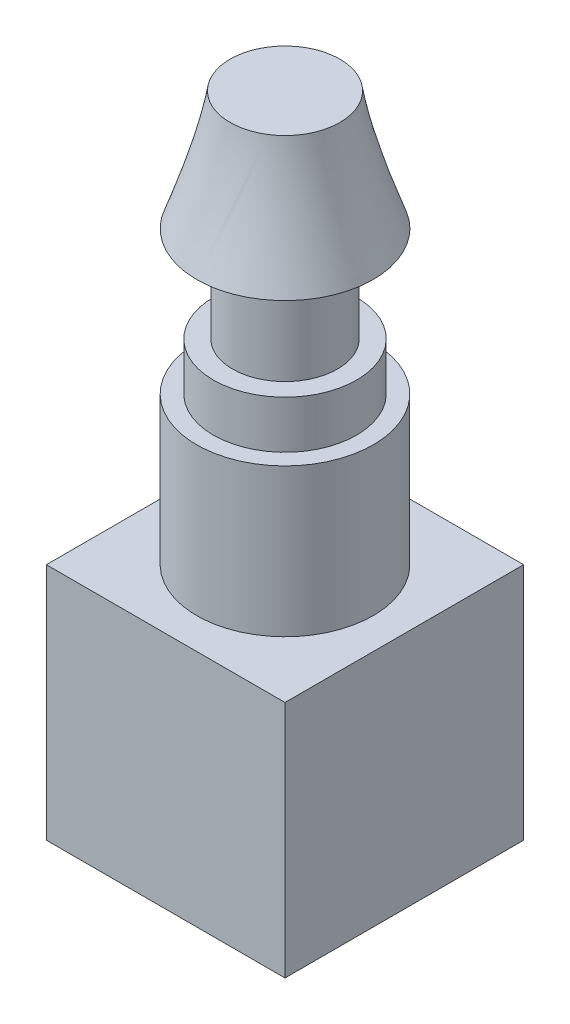
ISO-10303-21;
HEADER;
FILE_DESCRIPTION(('STEP AP214'),'2;1');
FILE_NAME('part.step','',(''),(''),'','','');
FILE_SCHEMA(('AUTOMOTIVE_DESIGN { 1 0 10303 214 1 1 1 1 }'));
ENDSEC;
DATA;
#1=APPLICATION_CONTEXT('core data for automotive mechanical design processes');
#2=APPLICATION_PROTOCOL_DEFINITION('international standard','automotive_design',2000,#1);
#3=PRODUCT_CONTEXT('',#1,'mechanical');
#4=PRODUCT('Part','Part','',(#3));
#5=PRODUCT_RELATED_PRODUCT_CATEGORY('part','',(#4));
#6=PRODUCT_DEFINITION_FORMATION('','',#4);
#7=PRODUCT_DEFINITION_CONTEXT('part definition',#1,'design');
#8=PRODUCT_DEFINITION('design','',#6,#7);
#9=PRODUCT_DEFINITION_SHAPE('','',#8);
#10=(LENGTH_UNIT() NAMED_UNIT(*) SI_UNIT(.MILLI.,.METRE.));
#11=(NAMED_UNIT(*) PLANE_ANGLE_UNIT() SI_UNIT($,.RADIAN.));
#12=(NAMED_UNIT(*) SI_UNIT($,.STERADIAN.) SOLID_ANGLE_UNIT());
#13=UNCERTAINTY_MEASURE_WITH_UNIT(LENGTH_MEASURE(1.E-05),#10,'distance_accuracy_value','');
#14=(GEOMETRIC_REPRESENTATION_CONTEXT(3) GLOBAL_UNCERTAINTY_ASSIGNED_CONTEXT((#13)) GLOBAL_UNIT_ASSIGNED_CONTEXT((#10,
#11,#12)) REPRESENTATION_CONTEXT('',''));
#15=CARTESIAN_POINT('',(0.,0.,0.));
#16=DIRECTION('',(0.,0.,1.));
#17=DIRECTION('',(1.,0.,0.));
#18=AXIS2_PLACEMENT_3D('',#15,#16,#17);
#19=CARTESIAN_POINT('',(0.,3.1,0.));
#20=DIRECTION('',(0.,-1.,0.));
#21=DIRECTION('',(0.,0.,-1.));
#22=AXIS2_PLACEMENT_3D('',#19,#20,#21);
#23=CYLINDRICAL_SURFACE('',#22,1.85);
#24=CARTESIAN_POINT('',(0.,3.1,0.));
#25=DIRECTION('',(0.,1.,0.));
#26=DIRECTION('',(0.,0.,1.));
#27=AXIS2_PLACEMENT_3D('',#24,#25,#26);
#28=CIRCLE('',#27,1.85);
#29=CARTESIAN_POINT('',(0.,3.1,-1.85));
#30=VERTEX_POINT('',#29);
#31=EDGE_CURVE('E175',#30,#30,#28,.T.);
#32=CARTESIAN_POINT('',(0.,0.,0.));
#33=DIRECTION('',(0.,1.,0.));
#34=DIRECTION('',(0.,0.,1.));
#35=AXIS2_PLACEMENT_3D('',#32,#33,#34);
#36=CIRCLE('',#35,1.85);
#37=CARTESIAN_POINT('',(0.,0.,-1.85));
#38=VERTEX_POINT('',#37);
#39=EDGE_CURVE('E42',#38,#38,#36,.T.);
#40=CARTESIAN_POINT('',(0.,3.1,-1.85));
#41=CARTESIAN_POINT('',(0.,3.06770833333333,-1.85));
#42=CARTESIAN_POINT('',(0.,3.03541666666667,-1.85));
#43=CARTESIAN_POINT('',(0.,2.97083333333333,-1.85));
#44=CARTESIAN_POINT('',(0.,2.93854166666667,-1.85));
#45=CARTESIAN_POINT('',(0.,2.87395833333333,-1.85));
#46=CARTESIAN_POINT('',(0.,2.84166666666667,-1.85));
#47=CARTESIAN_POINT('',(0.,2.77708333333333,-1.85));
#48=CARTESIAN_POINT('',(0.,2.74479166666667,-1.85));
#49=CARTESIAN_POINT('',(0.,2.68020833333333,-1.85));
#50=CARTESIAN_POINT('',(0.,2.64791666666667,-1.85));
#51=CARTESIAN_POINT('',(0.,2.58333333333333,-1.85));
#52=CARTESIAN_POINT('',(0.,2.55104166666667,-1.85));
#53=CARTESIAN_POINT('',(0.,2.48645833333333,-1.85));
#54=CARTESIAN_POINT('',(0.,2.45416666666667,-1.85));
#55=CARTESIAN_POINT('',(0.,2.38958333333333,-1.85));
#56=CARTESIAN_POINT('',(0.,2.35729166666667,-1.85));
#57=CARTESIAN_POINT('',(0.,2.29270833333333,-1.85));
#58=CARTESIAN_POINT('',(0.,2.26041666666667,-1.85));
#59=CARTESIAN_POINT('',(0.,2.19583333333333,-1.85));
#60=CARTESIAN_POINT('',(0.,2.16354166666667,-1.85));
#61=CARTESIAN_POINT('',(0.,2.09895833333333,-1.85));
#62=CARTESIAN_POINT('',(0.,2.06666666666667,-1.85));
#63=CARTESIAN_POINT('',(0.,2.00208333333333,-1.85));
#64=CARTESIAN_POINT('',(0.,1.96979166666667,-1.85));
#65=CARTESIAN_POINT('',(0.,1.90520833333333,-1.85));
#66=CARTESIAN_POINT('',(0.,1.87291666666667,-1.85));
#67=CARTESIAN_POINT('',(0.,1.80833333333333,-1.85));
#68=CARTESIAN_POINT('',(0.,1.77604166666667,-1.85));
#69=CARTESIAN_POINT('',(0.,1.71145833333333,-1.85));
#70=CARTESIAN_POINT('',(0.,1.67916666666667,-1.85));
#71=CARTESIAN_POINT('',(0.,1.61458333333333,-1.85));
#72=CARTESIAN_POINT('',(0.,1.58229166666667,-1.85));
#73=CARTESIAN_POINT('',(0.,1.51770833333333,-1.85));
#74=CARTESIAN_POINT('',(0.,1.48541666666667,-1.85));
#75=CARTESIAN_POINT('',(0.,1.42083333333333,-1.85));
#76=CARTESIAN_POINT('',(0.,1.38854166666667,-1.85));
#77=CARTESIAN_POINT('',(0.,1.32395833333333,-1.85));
#78=CARTESIAN_POINT('',(0.,1.29166666666667,-1.85));
#79=CARTESIAN_POINT('',(0.,1.22708333333333,-1.85));
#80=CARTESIAN_POINT('',(0.,1.19479166666667,-1.85));
#81=CARTESIAN_POINT('',(0.,1.13020833333333,-1.85));
#82=CARTESIAN_POINT('',(0.,1.09791666666667,-1.85));
#83=CARTESIAN_POINT('',(0.,1.03333333333333,-1.85));
#84=CARTESIAN_POINT('',(0.,1.00104166666667,-1.85));
#85=CARTESIAN_POINT('',(0.,0.936458333333333,-1.85));
#86=CARTESIAN_POINT('',(0.,0.904166666666667,-1.85));
#87=CARTESIAN_POINT('',(0.,0.839583333333333,-1.85));
#88=CARTESIAN_POINT('',(0.,0.807291666666667,-1.85));
#89=CARTESIAN_POINT('',(0.,0.742708333333333,-1.85));
#90=CARTESIAN_POINT('',(0.,0.710416666666667,-1.85));
#91=CARTESIAN_POINT('',(0.,0.645833333333333,-1.85));
#92=CARTESIAN_POINT('',(0.,0.613541666666667,-1.85));
#93=CARTESIAN_POINT('',(0.,0.548958333333333,-1.85));
#94=CARTESIAN_POINT('',(0.,0.516666666666667,-1.85));
#95=CARTESIAN_POINT('',(0.,0.452083333333333,-1.85));
#96=CARTESIAN_POINT('',(0.,0.419791666666667,-1.85));
#97=CARTESIAN_POINT('',(0.,0.355208333333333,-1.85));
#98=CARTESIAN_POINT('',(0.,0.322916666666667,-1.85));
#99=CARTESIAN_POINT('',(0.,0.258333333333333,-1.85));
#100=CARTESIAN_POINT('',(0.,0.226041666666667,-1.85));
#101=CARTESIAN_POINT('',(0.,0.161458333333333,-1.85));
#102=CARTESIAN_POINT('',(0.,0.129166666666667,-1.85));
#103=CARTESIAN_POINT('',(0.,0.0645833333333335,-1.85));
#104=CARTESIAN_POINT('',(0.,0.0322916666666667,-1.85));
#105=CARTESIAN_POINT('',(0.,0.,-1.85));
#106=B_SPLINE_CURVE_WITH_KNOTS('',3,(#40,#41,#42,#43,#44,#45,#46,#47,#48,#49,#50,#51,#52,#53,
#54,#55,#56,#57,#58,#59,#60,#61,#62,#63,#64,#65,#66,#67,#68,#69,#70,#71,#72,#73,#74,#75,#76,#77,
#78,#79,#80,#81,#82,#83,#84,#85,#86,#87,#88,#89,#90,#91,#92,#93,#94,#95,#96,#97,#98,#99,#100,
#101,#102,#103,#104,#105),.UNSPECIFIED.,.F.,.F.,(4,2,2,2,2,2,2,2,2,2,2,2,2,2,2,2,2,2,2,2,2,2,2,
2,2,2,2,2,2,2,2,2,4),(0.,0.0968749999999997,0.19375,0.290625,0.3875,0.484375,0.58125,0.678125,
0.775,0.871874999999999,0.96875,1.065625,1.1625,1.259375,1.35625,1.453125,1.55,1.646875,1.74375,
1.840625,1.9375,2.034375,2.13125,2.228125,2.325,2.421875,2.51875,2.615625,2.7125,2.809375,
2.90625,3.003125,3.1),.UNSPECIFIED.);
#107=EDGE_CURVE('BSEAM39',#30,#38,#106,.T.);
#108=ORIENTED_EDGE('',*,*,#31,.F.);
#109=ORIENTED_EDGE('',*,*,#39,.T.);
#110=ORIENTED_EDGE('',*,*,#107,.T.);
#111=ORIENTED_EDGE('',*,*,#107,.F.);
#112=EDGE_LOOP('',(#108,#110,#109,#111));
#113=FACE_BOUND('',#112,.T.);
#114=ADVANCED_FACE('F39',(#113),#23,.T.);
#115=CARTESIAN_POINT('',(0.,3.1,0.));
#116=DIRECTION('',(0.,1.,0.));
#117=DIRECTION('',(0.,0.,1.));
#118=AXIS2_PLACEMENT_3D('',#115,#116,#117);
#119=PLANE('',#118);
#120=CARTESIAN_POINT('',(0.,3.1,0.));
#121=DIRECTION('',(0.,1.,0.));
#122=DIRECTION('',(0.,0.,1.));
#123=AXIS2_PLACEMENT_3D('',#120,#121,#122);
#124=CIRCLE('',#123,1.5);
#125=CARTESIAN_POINT('',(0.,3.1,1.5));
#126=VERTEX_POINT('',#125);
#127=EDGE_CURVE('E48',#126,#126,#124,.T.);
#128=ORIENTED_EDGE('',*,*,#127,.F.);
#129=EDGE_LOOP('',(#128));
#130=FACE_BOUND('',#129,.T.);
#131=ORIENTED_EDGE('',*,*,#31,.T.);
#132=EDGE_LOOP('',(#131));
#133=FACE_BOUND('',#132,.T.);
#134=ADVANCED_FACE('F180',(#130,#133),#119,.T.);
#135=CARTESIAN_POINT('',(0.,4.1,0.));
#136=DIRECTION('',(0.,-1.,0.));
#137=DIRECTION('',(0.,0.,-1.));
#138=AXIS2_PLACEMENT_3D('',#135,#136,#137);
#139=CYLINDRICAL_SURFACE('',#138,1.5);
#140=CARTESIAN_POINT('',(0.,4.1,0.));
#141=DIRECTION('',(0.,1.,0.));
#142=DIRECTION('',(0.,0.,1.));
#143=AXIS2_PLACEMENT_3D('',#140,#141,#142);
#144=CIRCLE('',#143,1.5);
#145=CARTESIAN_POINT('',(0.,4.1,1.5));
#146=VERTEX_POINT('',#145);
#147=EDGE_CURVE('E171',#146,#146,#144,.T.);
#148=ORIENTED_EDGE('',*,*,#147,.F.);
#149=EDGE_LOOP('',(#148));
#150=FACE_BOUND('',#149,.T.);
#151=ORIENTED_EDGE('',*,*,#127,.T.);
#152=EDGE_LOOP('',(#151));
#153=FACE_BOUND('',#152,.T.);
#154=ADVANCED_FACE('F203',(#150,#153),#139,.T.);
#155=CARTESIAN_POINT('',(0.,4.1,0.));
#156=DIRECTION('',(0.,1.,0.));
#157=DIRECTION('',(0.,0.,1.));
#158=AXIS2_PLACEMENT_3D('',#155,#156,#157);
#159=PLANE('',#158);
#160=CARTESIAN_POINT('',(0.,4.1,0.));
#161=DIRECTION('',(0.,1.,0.));
#162=DIRECTION('',(0.,0.,1.));
#163=AXIS2_PLACEMENT_3D('',#160,#161,#162);
#164=CIRCLE('',#163,1.1);
#165=CARTESIAN_POINT('',(0.,4.1,1.1));
#166=VERTEX_POINT('',#165);
#167=EDGE_CURVE('E12',#166,#166,#164,.T.);
#168=ORIENTED_EDGE('',*,*,#167,.F.);
#169=EDGE_LOOP('',(#168));
#170=FACE_BOUND('',#169,.T.);
#171=ORIENTED_EDGE('',*,*,#147,.T.);
#172=EDGE_LOOP('',(#171));
#173=FACE_BOUND('',#172,.T.);
#174=ADVANCED_FACE('F198',(#170,#173),#159,.T.);
#175=CARTESIAN_POINT('',(0.,6.1,0.));
#176=DIRECTION('',(0.,-1.,0.));
#177=DIRECTION('',(0.,0.,-1.));
#178=AXIS2_PLACEMENT_3D('',#175,#176,#177);
#179=CYLINDRICAL_SURFACE('',#178,1.1);
#180=CARTESIAN_POINT('',(0.,6.1,0.));
#181=DIRECTION('',(0.,1.,0.));
#182=DIRECTION('',(0.,0.,1.));
#183=AXIS2_PLACEMENT_3D('',#180,#181,#182);
#184=CIRCLE('',#183,1.1);
#185=CARTESIAN_POINT('',(0.,6.1,1.1));
#186=VERTEX_POINT('',#185);
#187=EDGE_CURVE('E167',#186,#186,#184,.T.);
#188=ORIENTED_EDGE('',*,*,#187,.F.);
#189=EDGE_LOOP('',(#188));
#190=FACE_BOUND('',#189,.T.);
#191=ORIENTED_EDGE('',*,*,#167,.T.);
#192=EDGE_LOOP('',(#191));
#193=FACE_BOUND('',#192,.T.);
#194=ADVANCED_FACE('F154',(#190,#193),#179,.T.);
#195=CARTESIAN_POINT('',(0.,8.6,0.));
#196=DIRECTION('',(0.,1.,0.));
#197=DIRECTION('',(0.,0.,1.));
#198=AXIS2_PLACEMENT_3D('',#195,#196,#197);
#199=PLANE('',#198);
#200=CARTESIAN_POINT('',(0.,8.6,0.));
#201=DIRECTION('',(0.,1.,0.));
#202=DIRECTION('',(0.,0.,1.));
#203=AXIS2_PLACEMENT_3D('',#200,#201,#202);
#204=CIRCLE('',#203,1.15);
#205=CARTESIAN_POINT('',(0.620465420838555,8.6,0.968257538851949));
#206=VERTEX_POINT('',#205);
#207=EDGE_CURVE('E122',#206,#206,#204,.T.);
#208=ORIENTED_EDGE('',*,*,#207,.T.);
#209=EDGE_LOOP('',(#208));
#210=FACE_BOUND('',#209,.T.);
#211=ADVANCED_FACE('F145',(#210),#199,.T.);
#212=CARTESIAN_POINT('',(0.,6.1,0.));
#213=DIRECTION('',(0.,1.,0.));
#214=DIRECTION('',(0.,0.,1.));
#215=AXIS2_PLACEMENT_3D('',#212,#213,#214);
#216=PLANE('',#215);
#217=ORIENTED_EDGE('',*,*,#187,.T.);
#218=EDGE_LOOP('',(#217));
#219=FACE_BOUND('',#218,.T.);
#220=CARTESIAN_POINT('',(0.,6.1,0.));
#221=DIRECTION('',(0.,1.,0.));
#222=DIRECTION('',(0.,0.,1.));
#223=AXIS2_PLACEMENT_3D('',#220,#221,#222);
#224=CIRCLE('',#223,1.85);
#225=CARTESIAN_POINT('',(0.,6.1,1.85));
#226=VERTEX_POINT('',#225);
#227=EDGE_CURVE('E127',#226,#226,#224,.T.);
#228=ORIENTED_EDGE('',*,*,#227,.F.);
#229=EDGE_LOOP('',(#228));
#230=FACE_BOUND('',#229,.T.);
#231=ADVANCED_FACE('F142',(#219,#230),#216,.F.);
#232=CARTESIAN_POINT('',(0.,6.1,1.85));
#233=CARTESIAN_POINT('',(0.620465420838555,8.6,0.968257538851949));
#234=CARTESIAN_POINT('',(3.7,6.1,1.85));
#235=CARTESIAN_POINT('',(2.55698049854245,8.6,-0.272673302825161));
#236=CARTESIAN_POINT('',(3.7,6.1,-1.85));
#237=CARTESIAN_POINT('',(1.31604965686534,8.6,-2.20918838052906));
#238=CARTESIAN_POINT('',(0.,6.1,-1.85));
#239=CARTESIAN_POINT('',(-0.620465420838555,8.6,-0.96825753885195));
#240=CARTESIAN_POINT('',(-3.7,6.1,-1.85));
#241=CARTESIAN_POINT('',(-2.55698049854246,8.6,0.272673302825162));
#242=CARTESIAN_POINT('',(-3.7,6.1,1.85));
#243=CARTESIAN_POINT('',(-1.31604965686534,8.6,2.20918838052906));
#244=CARTESIAN_POINT('',(0.,6.1,1.85));
#245=CARTESIAN_POINT('',(0.620465420838555,8.6,0.968257538851949));
#246=(BOUNDED_SURFACE() B_SPLINE_SURFACE(3,1,((#232,#233),(#234,#235),(#236,#237),(#238,#239),
(#240,#241),(#242,#243),(#244,#245)),.UNSPECIFIED.,.T.,.F.,.F.) B_SPLINE_SURFACE_WITH_KNOTS((4,
3,4),(2,2),(0.,0.5,1.),(0.,1.),
.UNSPECIFIED.) GEOMETRIC_REPRESENTATION_ITEM() RATIONAL_B_SPLINE_SURFACE(((1.,1.),
(0.333333333333333,0.333333333333333),(0.333333333333333,0.333333333333333),(1.,1.),
(0.333333333333333,0.333333333333333),(0.333333333333333,0.333333333333333),(1.,1.))) REPRESENTATION_ITEM('') SURFACE());
#247=CARTESIAN_POINT('',(0.,6.1,1.85));
#248=CARTESIAN_POINT('',(0.00646318146706835,6.12604166666667,1.84081518269637));
#249=CARTESIAN_POINT('',(0.0129263629341366,6.15208333333333,1.83163036539275));
#250=CARTESIAN_POINT('',(0.0258527258682731,6.20416666666667,1.8132607307855));
#251=CARTESIAN_POINT('',(0.0323159073353414,6.23020833333333,1.80407591348187));
#252=CARTESIAN_POINT('',(0.045242270269478,6.28229166666667,1.78570627887462));
#253=CARTESIAN_POINT('',(0.0517054517365463,6.30833333333333,1.776521461571));
#254=CARTESIAN_POINT('',(0.0646318146706829,6.36041666666667,1.75815182696374));
#255=CARTESIAN_POINT('',(0.0710949961377511,6.38645833333333,1.74896700966012));
#256=CARTESIAN_POINT('',(0.0840213590718877,6.43854166666667,1.73059737505287));
#257=CARTESIAN_POINT('',(0.090484540538956,6.46458333333333,1.72141255774924));
#258=CARTESIAN_POINT('',(0.103410903473093,6.51666666666667,1.70304292314199));
#259=CARTESIAN_POINT('',(0.109874084940161,6.54270833333333,1.69385810583837));
#260=CARTESIAN_POINT('',(0.122800447874297,6.59479166666667,1.67548847123112));
#261=CARTESIAN_POINT('',(0.129263629341366,6.62083333333333,1.66630365392749));
#262=CARTESIAN_POINT('',(0.142189992275502,6.67291666666667,1.64793401932024));
#263=CARTESIAN_POINT('',(0.148653173742571,6.69895833333333,1.63874920201661));
#264=CARTESIAN_POINT('',(0.161579536676707,6.75104166666667,1.62037956740936));
#265=CARTESIAN_POINT('',(0.168042718143775,6.77708333333333,1.61119475010574));
#266=CARTESIAN_POINT('',(0.180969081077912,6.82916666666667,1.59282511549849));
#267=CARTESIAN_POINT('',(0.18743226254498,6.85520833333333,1.58364029819486));
#268=CARTESIAN_POINT('',(0.200358625479117,6.90729166666667,1.56527066358761));
#269=CARTESIAN_POINT('',(0.206821806946185,6.93333333333333,1.55608584628398));
#270=CARTESIAN_POINT('',(0.219748169880322,6.98541666666667,1.53771621167673));
#271=CARTESIAN_POINT('',(0.22621135134739,7.01145833333333,1.52853139437311));
#272=CARTESIAN_POINT('',(0.239137714281527,7.06354166666667,1.51016175976586));
#273=CARTESIAN_POINT('',(0.245600895748595,7.08958333333333,1.50097694246223));
#274=CARTESIAN_POINT('',(0.258527258682731,7.14166666666667,1.48260730785498));
#275=CARTESIAN_POINT('',(0.2649904401498,7.16770833333333,1.47342249055135));
#276=CARTESIAN_POINT('',(0.277916803083936,7.21979166666667,1.4550528559441));
#277=CARTESIAN_POINT('',(0.284379984551005,7.24583333333333,1.44586803864048));
#278=CARTESIAN_POINT('',(0.297306347485141,7.29791666666667,1.42749840403323));
#279=CARTESIAN_POINT('',(0.303769528952209,7.32395833333333,1.4183135867296));
#280=CARTESIAN_POINT('',(0.316695891886346,7.37604166666667,1.39994395212235));
#281=CARTESIAN_POINT('',(0.323159073353414,7.40208333333333,1.39075913481872));
#282=CARTESIAN_POINT('',(0.336085436287551,7.45416666666667,1.37238950021147));
#283=CARTESIAN_POINT('',(0.342548617754619,7.48020833333333,1.36320468290785));
#284=CARTESIAN_POINT('',(0.355474980688756,7.53229166666667,1.3448350483006));
#285=CARTESIAN_POINT('',(0.361938162155824,7.55833333333333,1.33565023099697));
#286=CARTESIAN_POINT('',(0.374864525089961,7.61041666666667,1.31728059638972));
#287=CARTESIAN_POINT('',(0.381327706557029,7.63645833333333,1.30809577908609));
#288=CARTESIAN_POINT('',(0.394254069491165,7.68854166666667,1.28972614447884));
#289=CARTESIAN_POINT('',(0.400717250958234,7.71458333333333,1.28054132717522));
#290=CARTESIAN_POINT('',(0.41364361389237,7.76666666666667,1.26217169256797));
#291=CARTESIAN_POINT('',(0.420106795359439,7.79270833333333,1.25298687526434));
#292=CARTESIAN_POINT('',(0.433033158293575,7.84479166666667,1.23461724065709));
#293=CARTESIAN_POINT('',(0.439496339760643,7.87083333333333,1.22543242335346));
#294=CARTESIAN_POINT('',(0.45242270269478,7.92291666666667,1.20706278874621));
#295=CARTESIAN_POINT('',(0.458885884161848,7.94895833333333,1.19787797144259));
#296=CARTESIAN_POINT('',(0.471812247095985,8.00104166666667,1.17950833683534));
#297=CARTESIAN_POINT('',(0.478275428563053,8.02708333333333,1.17032351953171));
#298=CARTESIAN_POINT('',(0.49120179149719,8.07916666666667,1.15195388492446));
#299=CARTESIAN_POINT('',(0.497664972964258,8.10520833333333,1.14276906762083));
#300=CARTESIAN_POINT('',(0.510591335898395,8.15729166666667,1.12439943301358));
#301=CARTESIAN_POINT('',(0.517054517365463,8.18333333333333,1.11521461570996));
#302=CARTESIAN_POINT('',(0.529980880299599,8.23541666666667,1.09684498110271));
#303=CARTESIAN_POINT('',(0.536444061766668,8.26145833333333,1.08766016379908));
#304=CARTESIAN_POINT('',(0.549370424700804,8.31354166666667,1.06929052919183));
#305=CARTESIAN_POINT('',(0.555833606167872,8.33958333333333,1.0601057118882));
#306=CARTESIAN_POINT('',(0.568759969102009,8.39166666666667,1.04173607728095));
#307=CARTESIAN_POINT('',(0.575223150569077,8.41770833333333,1.03255125997733));
#308=CARTESIAN_POINT('',(0.588149513503214,8.46979166666667,1.01418162537008));
#309=CARTESIAN_POINT('',(0.594612694970282,8.49583333333333,1.00499680806645));
#310=CARTESIAN_POINT('',(0.607539057904419,8.54791666666667,0.9866271734592));
#311=CARTESIAN_POINT('',(0.614002239371487,8.57395833333333,0.977442356155575));
#312=CARTESIAN_POINT('',(0.620465420838555,8.6,0.968257538851949));
#313=B_SPLINE_CURVE_WITH_KNOTS('',3,(#247,#248,#249,#250,#251,#252,#253,#254,#255,#256,#257,
#258,#259,#260,#261,#262,#263,#264,#265,#266,#267,#268,#269,#270,#271,#272,#273,#274,#275,#276,
#277,#278,#279,#280,#281,#282,#283,#284,#285,#286,#287,#288,#289,#290,#291,#292,#293,#294,#295,
#296,#297,#298,#299,#300,#301,#302,#303,#304,#305,#306,#307,#308,#309,#310,#311,#312),
.UNSPECIFIED.,.F.,.F.,(4,2,2,2,2,2,2,2,2,2,2,2,2,2,2,2,2,2,2,2,2,2,2,2,2,2,2,2,2,2,2,2,4),(0.,
0.0850806551290898,0.17016131025818,0.255241965387269,0.340322620516359,0.425403275645449,
0.510483930774539,0.595564585903629,0.680645241032718,0.765725896161807,0.850806551290897,
0.935887206419988,1.02096786154908,1.10604851667817,1.19112917180726,1.27620982693635,
1.36129048206544,1.44637113719453,1.53145179232361,1.6165324474527,1.70161310258179,
1.78669375771088,1.87177441283997,1.95685506796906,2.04193572309815,2.12701637822724,
2.21209703335633,2.29717768848542,2.38225834361451,2.4673389987436,2.55241965387269,
2.63750030900178,2.72258096413087),.UNSPECIFIED.);
#314=EDGE_CURVE('BSEAM129',#226,#206,#313,.T.);
#315=ORIENTED_EDGE('',*,*,#227,.T.);
#316=ORIENTED_EDGE('',*,*,#207,.F.);
#317=ORIENTED_EDGE('',*,*,#314,.T.);
#318=ORIENTED_EDGE('',*,*,#314,.F.);
#319=EDGE_LOOP('',(#315,#317,#316,#318));
#320=FACE_BOUND('',#319,.T.);
#321=ADVANCED_FACE('F129',(#320),#246,.T.);
#322=CARTESIAN_POINT('',(2.5,-5.,2.5));
#323=DIRECTION('',(-1.,0.,0.));
#324=DIRECTION('',(0.,0.,1.));
#325=AXIS2_PLACEMENT_3D('',#322,#323,#324);
#326=PLANE('',#325);
#327=DIRECTION('',(0.,0.,1.));
#328=VECTOR('',#327,1.);
#329=CARTESIAN_POINT('',(2.5,0.,2.5));
#330=LINE('',#329,#328);
#331=CARTESIAN_POINT('',(2.5,0.,-2.5));
#332=VERTEX_POINT('',#331);
#333=CARTESIAN_POINT('',(2.5,0.,2.5));
#334=VERTEX_POINT('',#333);
#335=EDGE_CURVE('E108',#332,#334,#330,.T.);
#336=ORIENTED_EDGE('',*,*,#335,.T.);
#337=DIRECTION('',(0.,1.,0.));
#338=VECTOR('',#337,1.);
#339=CARTESIAN_POINT('',(2.5,-5.,2.5));
#340=LINE('',#339,#338);
#341=CARTESIAN_POINT('',(2.5,-5.,2.5));
#342=VERTEX_POINT('',#341);
#343=EDGE_CURVE('E99',#342,#334,#340,.T.);
#344=ORIENTED_EDGE('',*,*,#343,.F.);
#345=DIRECTION('',(0.,0.,1.));
#346=VECTOR('',#345,1.);
#347=CARTESIAN_POINT('',(2.5,-5.,2.5));
#348=LINE('',#347,#346);
#349=CARTESIAN_POINT('',(2.5,-5.,-2.5));
#350=VERTEX_POINT('',#349);
#351=EDGE_CURVE('E93',#350,#342,#348,.T.);
#352=ORIENTED_EDGE('',*,*,#351,.F.);
#353=DIRECTION('',(0.,1.,0.));
#354=VECTOR('',#353,1.);
#355=CARTESIAN_POINT('',(2.5,-5.,-2.5));
#356=LINE('',#355,#354);
#357=EDGE_CURVE('E104',#350,#332,#356,.T.);
#358=ORIENTED_EDGE('',*,*,#357,.T.);
#359=EDGE_LOOP('',(#336,#344,#352,#358));
#360=FACE_BOUND('',#359,.T.);
#361=ADVANCED_FACE('F141',(#360),#326,.F.);
#362=CARTESIAN_POINT('',(-2.5,-5.,2.5));
#363=DIRECTION('',(0.,0.,-1.));
#364=DIRECTION('',(-1.,0.,0.));
#365=AXIS2_PLACEMENT_3D('',#362,#363,#364);
#366=PLANE('',#365);
#367=DIRECTION('',(-1.,0.,0.));
#368=VECTOR('',#367,1.);
#369=CARTESIAN_POINT('',(-2.5,0.,2.5));
#370=LINE('',#369,#368);
#371=CARTESIAN_POINT('',(-2.5,0.,2.5));
#372=VERTEX_POINT('',#371);
#373=EDGE_CURVE('E98',#334,#372,#370,.T.);
#374=ORIENTED_EDGE('',*,*,#373,.T.);
#375=DIRECTION('',(0.,1.,0.));
#376=VECTOR('',#375,1.);
#377=CARTESIAN_POINT('',(-2.5,-5.,2.5));
#378=LINE('',#377,#376);
#379=CARTESIAN_POINT('',(-2.5,-5.,2.5));
#380=VERTEX_POINT('',#379);
#381=EDGE_CURVE('E96',#380,#372,#378,.T.);
#382=ORIENTED_EDGE('',*,*,#381,.F.);
#383=DIRECTION('',(-1.,0.,0.));
#384=VECTOR('',#383,1.);
#385=CARTESIAN_POINT('',(-2.5,-5.,2.5));
#386=LINE('',#385,#384);
#387=EDGE_CURVE('E88',#342,#380,#386,.T.);
#388=ORIENTED_EDGE('',*,*,#387,.F.);
#389=ORIENTED_EDGE('',*,*,#343,.T.);
#390=EDGE_LOOP('',(#374,#382,#388,#389));
#391=FACE_BOUND('',#390,.T.);
#392=ADVANCED_FACE('F97',(#391),#366,.F.);
#393=CARTESIAN_POINT('',(-2.5,-5.,2.5));
#394=DIRECTION('',(1.,0.,0.));
#395=DIRECTION('',(0.,0.,-1.));
#396=AXIS2_PLACEMENT_3D('',#393,#394,#395);
#397=PLANE('',#396);
#398=DIRECTION('',(0.,0.,-1.));
#399=VECTOR('',#398,1.);
#400=CARTESIAN_POINT('',(-2.5,0.,2.5));
#401=LINE('',#400,#399);
#402=CARTESIAN_POINT('',(-2.5,0.,-2.5));
#403=VERTEX_POINT('',#402);
#404=EDGE_CURVE('E74',#372,#403,#401,.T.);
#405=ORIENTED_EDGE('',*,*,#404,.T.);
#406=DIRECTION('',(0.,1.,0.));
#407=VECTOR('',#406,1.);
#408=CARTESIAN_POINT('',(-2.5,-5.,-2.5));
#409=LINE('',#408,#407);
#410=CARTESIAN_POINT('',(-2.5,-5.,-2.5));
#411=VERTEX_POINT('',#410);
#412=EDGE_CURVE('E100',#411,#403,#409,.T.);
#413=ORIENTED_EDGE('',*,*,#412,.F.);
#414=DIRECTION('',(0.,0.,-1.));
#415=VECTOR('',#414,1.);
#416=CARTESIAN_POINT('',(-2.5,-5.,2.5));
#417=LINE('',#416,#415);
#418=EDGE_CURVE('E91',#380,#411,#417,.T.);
#419=ORIENTED_EDGE('',*,*,#418,.F.);
#420=ORIENTED_EDGE('',*,*,#381,.T.);
#421=EDGE_LOOP('',(#405,#413,#419,#420));
#422=FACE_BOUND('',#421,.T.);
#423=ADVANCED_FACE('F102',(#422),#397,.F.);
#424=CARTESIAN_POINT('',(-2.5,-5.,-2.5));
#425=DIRECTION('',(0.,0.,1.));
#426=DIRECTION('',(1.,0.,0.));
#427=AXIS2_PLACEMENT_3D('',#424,#425,#426);
#428=PLANE('',#427);
#429=DIRECTION('',(1.,0.,0.));
#430=VECTOR('',#429,1.);
#431=CARTESIAN_POINT('',(-2.5,0.,-2.5));
#432=LINE('',#431,#430);
#433=EDGE_CURVE('E80',#403,#332,#432,.T.);
#434=ORIENTED_EDGE('',*,*,#433,.T.);
#435=ORIENTED_EDGE('',*,*,#357,.F.);
#436=DIRECTION('',(1.,0.,0.));
#437=VECTOR('',#436,1.);
#438=CARTESIAN_POINT('',(-2.5,-5.,-2.5));
#439=LINE('',#438,#437);
#440=EDGE_CURVE('E57',#411,#350,#439,.T.);
#441=ORIENTED_EDGE('',*,*,#440,.F.);
#442=ORIENTED_EDGE('',*,*,#412,.T.);
#443=EDGE_LOOP('',(#434,#435,#441,#442));
#444=FACE_BOUND('',#443,.T.);
#445=ADVANCED_FACE('F267',(#444),#428,.F.);
#446=CARTESIAN_POINT('',(0.,-5.,0.));
#447=DIRECTION('',(0.,-1.,0.));
#448=DIRECTION('',(0.,0.,-1.));
#449=AXIS2_PLACEMENT_3D('',#446,#447,#448);
#450=PLANE('',#449);
#451=CARTESIAN_POINT('',(0.,-5.,0.));
#452=DIRECTION('',(0.,-1.,0.));
#453=DIRECTION('',(0.,0.,-1.));
#454=AXIS2_PLACEMENT_3D('',#451,#452,#453);
#455=CIRCLE('',#454,0.9);
#456=CARTESIAN_POINT('',(0.,-5.,-0.9));
#457=VERTEX_POINT('',#456);
#458=EDGE_CURVE('E317',#457,#457,#455,.T.);
#459=ORIENTED_EDGE('',*,*,#458,.F.);
#460=EDGE_LOOP('',(#459));
#461=FACE_BOUND('',#460,.T.);
#462=ORIENTED_EDGE('',*,*,#351,.T.);
#463=ORIENTED_EDGE('',*,*,#387,.T.);
#464=ORIENTED_EDGE('',*,*,#418,.T.);
#465=ORIENTED_EDGE('',*,*,#440,.T.);
#466=EDGE_LOOP('',(#462,#463,#464,#465));
#467=FACE_BOUND('',#466,.T.);
#468=ADVANCED_FACE('F89',(#461,#467),#450,.T.);
#469=CARTESIAN_POINT('',(0.,0.,0.));
#470=DIRECTION('',(0.,-1.,0.));
#471=DIRECTION('',(0.,0.,-1.));
#472=AXIS2_PLACEMENT_3D('',#469,#470,#471);
#473=PLANE('',#472);
#474=ORIENTED_EDGE('',*,*,#39,.F.);
#475=EDGE_LOOP('',(#474));
#476=FACE_BOUND('',#475,.T.);
#477=ORIENTED_EDGE('',*,*,#335,.F.);
#478=ORIENTED_EDGE('',*,*,#433,.F.);
#479=ORIENTED_EDGE('',*,*,#404,.F.);
#480=ORIENTED_EDGE('',*,*,#373,.F.);
#481=EDGE_LOOP('',(#477,#478,#479,#480));
#482=FACE_BOUND('',#481,.T.);
#483=ADVANCED_FACE('F282',(#476,#482),#473,.F.);
#484=CARTESIAN_POINT('',(0.,-2.,0.));
#485=DIRECTION('',(0.,-1.,0.));
#486=DIRECTION('',(0.,0.,-1.));
#487=AXIS2_PLACEMENT_3D('',#484,#485,#486);
#488=CYLINDRICAL_SURFACE('',#487,0.9);
#489=CARTESIAN_POINT('',(0.,-2.,0.));
#490=DIRECTION('',(0.,-1.,0.));
#491=DIRECTION('',(0.,0.,-1.));
#492=AXIS2_PLACEMENT_3D('',#489,#490,#491);
#493=CIRCLE('',#492,0.9);
#494=CARTESIAN_POINT('',(0.,-2.,-0.9));
#495=VERTEX_POINT('',#494);
#496=EDGE_CURVE('E111',#495,#495,#493,.T.);
#497=ORIENTED_EDGE('',*,*,#496,.F.);
#498=EDGE_LOOP('',(#497));
#499=FACE_BOUND('',#498,.T.);
#500=ORIENTED_EDGE('',*,*,#458,.T.);
#501=EDGE_LOOP('',(#500));
#502=FACE_BOUND('',#501,.T.);
#503=ADVANCED_FACE('F287',(#499,#502),#488,.F.);
#504=CARTESIAN_POINT('',(0.,-2.,0.));
#505=DIRECTION('',(0.,-1.,0.));
#506=DIRECTION('',(0.,0.,-1.));
#507=AXIS2_PLACEMENT_3D('',#504,#505,#506);
#508=PLANE('',#507);
#509=ORIENTED_EDGE('',*,*,#496,.T.);
#510=EDGE_LOOP('',(#509));
#511=FACE_BOUND('',#510,.T.);
#512=ADVANCED_FACE('F301',(#511),#508,.T.);
#513=CLOSED_SHELL('',(#114,#134,#154,#174,#194,#211,#231,#321,#361,#392,#423,#445,#468,#483,
#503,#512));
#514=MANIFOLD_SOLID_BREP('B2',#513);
#515=ADVANCED_BREP_SHAPE_REPRESENTATION('',(#18,#514),#14);
#516=SHAPE_DEFINITION_REPRESENTATION(#9,#515);
ENDSEC;
END-ISO-10303-21;
